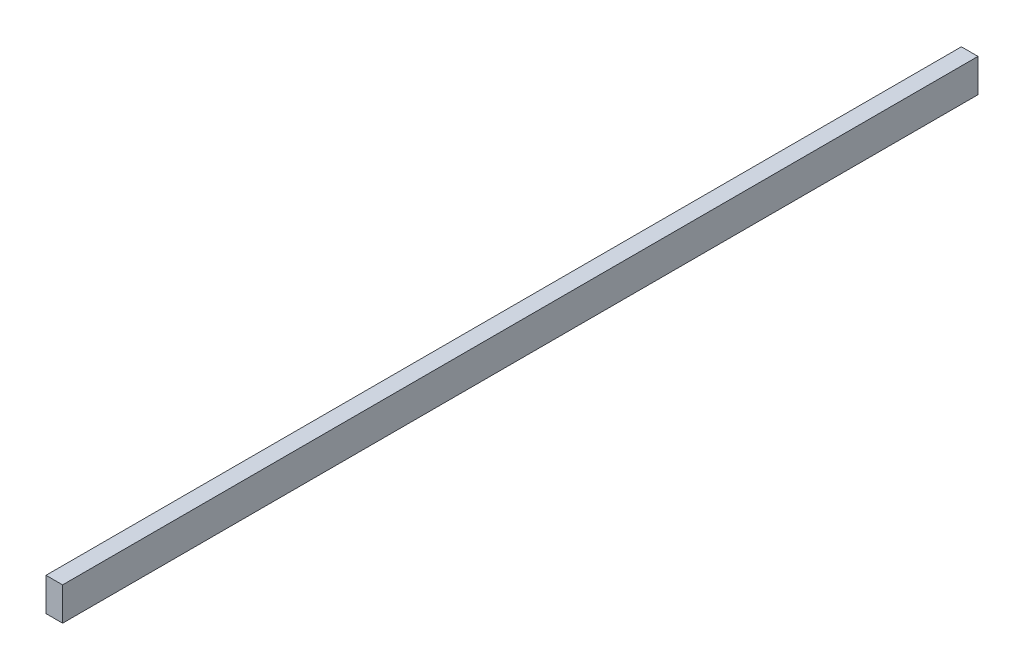
ISO-10303-21;
HEADER;
FILE_DESCRIPTION(('STEP AP214'),'2;1');
FILE_NAME('part.step','',(''),(''),'','','');
FILE_SCHEMA(('AUTOMOTIVE_DESIGN { 1 0 10303 214 1 1 1 1 }'));
ENDSEC;
DATA;
#1=APPLICATION_CONTEXT('core data for automotive mechanical design processes');
#2=APPLICATION_PROTOCOL_DEFINITION('international standard','automotive_design',2000,#1);
#3=PRODUCT_CONTEXT('',#1,'mechanical');
#4=PRODUCT('Part','Part','',(#3));
#5=PRODUCT_RELATED_PRODUCT_CATEGORY('part','',(#4));
#6=PRODUCT_DEFINITION_FORMATION('','',#4);
#7=PRODUCT_DEFINITION_CONTEXT('part definition',#1,'design');
#8=PRODUCT_DEFINITION('design','',#6,#7);
#9=PRODUCT_DEFINITION_SHAPE('','',#8);
#10=(LENGTH_UNIT() NAMED_UNIT(*) SI_UNIT(.MILLI.,.METRE.));
#11=(NAMED_UNIT(*) PLANE_ANGLE_UNIT() SI_UNIT($,.RADIAN.));
#12=(NAMED_UNIT(*) SI_UNIT($,.STERADIAN.) SOLID_ANGLE_UNIT());
#13=UNCERTAINTY_MEASURE_WITH_UNIT(LENGTH_MEASURE(1.E-05),#10,'distance_accuracy_value','');
#14=(GEOMETRIC_REPRESENTATION_CONTEXT(3) GLOBAL_UNCERTAINTY_ASSIGNED_CONTEXT((#13)) GLOBAL_UNIT_ASSIGNED_CONTEXT((#10,
#11,#12)) REPRESENTATION_CONTEXT('',''));
#15=CARTESIAN_POINT('',(0.,0.,0.));
#16=DIRECTION('',(0.,0.,1.));
#17=DIRECTION('',(1.,0.,0.));
#18=AXIS2_PLACEMENT_3D('',#15,#16,#17);
#19=CARTESIAN_POINT('',(-6.35,-12.7,-700.));
#20=DIRECTION('',(-1.,0.,0.));
#21=DIRECTION('',(0.,0.,1.));
#22=AXIS2_PLACEMENT_3D('',#19,#20,#21);
#23=PLANE('',#22);
#24=DIRECTION('',(0.,-1.,0.));
#25=VECTOR('',#24,1.);
#26=CARTESIAN_POINT('',(-6.35,-12.7,0.));
#27=LINE('',#26,#25);
#28=CARTESIAN_POINT('',(-6.35,12.7,0.));
#29=VERTEX_POINT('',#28);
#30=CARTESIAN_POINT('',(-6.35,-12.7,0.));
#31=VERTEX_POINT('',#30);
#32=EDGE_CURVE('E97',#29,#31,#27,.T.);
#33=ORIENTED_EDGE('',*,*,#32,.F.);
#34=DIRECTION('',(0.,0.,1.));
#35=VECTOR('',#34,1.);
#36=CARTESIAN_POINT('',(-6.35,12.7,-700.));
#37=LINE('',#36,#35);
#38=CARTESIAN_POINT('',(-6.35,12.7,-700.));
#39=VERTEX_POINT('',#38);
#40=EDGE_CURVE('E11',#39,#29,#37,.T.);
#41=ORIENTED_EDGE('',*,*,#40,.F.);
#42=DIRECTION('',(0.,-1.,0.));
#43=VECTOR('',#42,1.);
#44=CARTESIAN_POINT('',(-6.35,-12.7,-700.));
#45=LINE('',#44,#43);
#46=CARTESIAN_POINT('',(-6.35,-12.7,-700.));
#47=VERTEX_POINT('',#46);
#48=EDGE_CURVE('E91',#39,#47,#45,.T.);
#49=ORIENTED_EDGE('',*,*,#48,.T.);
#50=DIRECTION('',(0.,0.,1.));
#51=VECTOR('',#50,1.);
#52=CARTESIAN_POINT('',(-6.35,-12.7,-700.));
#53=LINE('',#52,#51);
#54=EDGE_CURVE('E36',#47,#31,#53,.T.);
#55=ORIENTED_EDGE('',*,*,#54,.T.);
#56=EDGE_LOOP('',(#33,#41,#49,#55));
#57=FACE_BOUND('',#56,.T.);
#58=ADVANCED_FACE('F33',(#57),#23,.T.);
#59=CARTESIAN_POINT('',(6.35,12.7,-700.));
#60=DIRECTION('',(0.,1.,0.));
#61=DIRECTION('',(0.,0.,1.));
#62=AXIS2_PLACEMENT_3D('',#59,#60,#61);
#63=PLANE('',#62);
#64=DIRECTION('',(-1.,0.,0.));
#65=VECTOR('',#64,1.);
#66=CARTESIAN_POINT('',(6.35,12.7,0.));
#67=LINE('',#66,#65);
#68=CARTESIAN_POINT('',(6.35,12.7,0.));
#69=VERTEX_POINT('',#68);
#70=EDGE_CURVE('E93',#69,#29,#67,.T.);
#71=ORIENTED_EDGE('',*,*,#70,.F.);
#72=DIRECTION('',(0.,0.,1.));
#73=VECTOR('',#72,1.);
#74=CARTESIAN_POINT('',(6.35,12.7,-700.));
#75=LINE('',#74,#73);
#76=CARTESIAN_POINT('',(6.35,12.7,-700.));
#77=VERTEX_POINT('',#76);
#78=EDGE_CURVE('E42',#77,#69,#75,.T.);
#79=ORIENTED_EDGE('',*,*,#78,.F.);
#80=DIRECTION('',(-1.,0.,0.));
#81=VECTOR('',#80,1.);
#82=CARTESIAN_POINT('',(6.35,12.7,-700.));
#83=LINE('',#82,#81);
#84=EDGE_CURVE('E88',#77,#39,#83,.T.);
#85=ORIENTED_EDGE('',*,*,#84,.T.);
#86=ORIENTED_EDGE('',*,*,#40,.T.);
#87=EDGE_LOOP('',(#71,#79,#85,#86));
#88=FACE_BOUND('',#87,.T.);
#89=ADVANCED_FACE('F107',(#88),#63,.T.);
#90=CARTESIAN_POINT('',(6.35,-12.7,-700.));
#91=DIRECTION('',(1.,0.,0.));
#92=DIRECTION('',(0.,0.,-1.));
#93=AXIS2_PLACEMENT_3D('',#90,#91,#92);
#94=PLANE('',#93);
#95=DIRECTION('',(0.,1.,0.));
#96=VECTOR('',#95,1.);
#97=CARTESIAN_POINT('',(6.35,-12.7,0.));
#98=LINE('',#97,#96);
#99=CARTESIAN_POINT('',(6.35,-12.7,0.));
#100=VERTEX_POINT('',#99);
#101=EDGE_CURVE('E83',#100,#69,#98,.T.);
#102=ORIENTED_EDGE('',*,*,#101,.F.);
#103=DIRECTION('',(0.,0.,1.));
#104=VECTOR('',#103,1.);
#105=CARTESIAN_POINT('',(6.35,-12.7,-700.));
#106=LINE('',#105,#104);
#107=CARTESIAN_POINT('',(6.35,-12.7,-700.));
#108=VERTEX_POINT('',#107);
#109=EDGE_CURVE('E78',#108,#100,#106,.T.);
#110=ORIENTED_EDGE('',*,*,#109,.F.);
#111=DIRECTION('',(0.,1.,0.));
#112=VECTOR('',#111,1.);
#113=CARTESIAN_POINT('',(6.35,-12.7,-700.));
#114=LINE('',#113,#112);
#115=EDGE_CURVE('E81',#108,#77,#114,.T.);
#116=ORIENTED_EDGE('',*,*,#115,.T.);
#117=ORIENTED_EDGE('',*,*,#78,.T.);
#118=EDGE_LOOP('',(#102,#110,#116,#117));
#119=FACE_BOUND('',#118,.T.);
#120=ADVANCED_FACE('F80',(#119),#94,.T.);
#121=CARTESIAN_POINT('',(6.35,-12.7,-700.));
#122=DIRECTION('',(0.,-1.,0.));
#123=DIRECTION('',(1.,0.,0.));
#124=AXIS2_PLACEMENT_3D('',#121,#122,#123);
#125=PLANE('',#124);
#126=DIRECTION('',(1.,0.,0.));
#127=VECTOR('',#126,1.);
#128=CARTESIAN_POINT('',(6.35,-12.7,0.));
#129=LINE('',#128,#127);
#130=EDGE_CURVE('E100',#31,#100,#129,.T.);
#131=ORIENTED_EDGE('',*,*,#130,.F.);
#132=ORIENTED_EDGE('',*,*,#54,.F.);
#133=DIRECTION('',(1.,0.,0.));
#134=VECTOR('',#133,1.);
#135=CARTESIAN_POINT('',(6.35,-12.7,-700.));
#136=LINE('',#135,#134);
#137=EDGE_CURVE('E87',#47,#108,#136,.T.);
#138=ORIENTED_EDGE('',*,*,#137,.T.);
#139=ORIENTED_EDGE('',*,*,#109,.T.);
#140=EDGE_LOOP('',(#131,#132,#138,#139));
#141=FACE_BOUND('',#140,.T.);
#142=ADVANCED_FACE('F90',(#141),#125,.T.);
#143=CARTESIAN_POINT('',(0.,0.,-700.));
#144=DIRECTION('',(0.,0.,1.));
#145=DIRECTION('',(1.,0.,0.));
#146=AXIS2_PLACEMENT_3D('',#143,#144,#145);
#147=PLANE('',#146);
#148=ORIENTED_EDGE('',*,*,#48,.F.);
#149=ORIENTED_EDGE('',*,*,#84,.F.);
#150=ORIENTED_EDGE('',*,*,#115,.F.);
#151=ORIENTED_EDGE('',*,*,#137,.F.);
#152=EDGE_LOOP('',(#148,#149,#150,#151));
#153=FACE_BOUND('',#152,.T.);
#154=ADVANCED_FACE('F86',(#153),#147,.F.);
#155=CARTESIAN_POINT('',(0.,0.,0.));
#156=DIRECTION('',(0.,0.,1.));
#157=DIRECTION('',(1.,0.,0.));
#158=AXIS2_PLACEMENT_3D('',#155,#156,#157);
#159=PLANE('',#158);
#160=ORIENTED_EDGE('',*,*,#32,.T.);
#161=ORIENTED_EDGE('',*,*,#130,.T.);
#162=ORIENTED_EDGE('',*,*,#101,.T.);
#163=ORIENTED_EDGE('',*,*,#70,.T.);
#164=EDGE_LOOP('',(#160,#161,#162,#163));
#165=FACE_BOUND('',#164,.T.);
#166=ADVANCED_FACE('F106',(#165),#159,.T.);
#167=CLOSED_SHELL('',(#58,#89,#120,#142,#154,#166));
#168=MANIFOLD_SOLID_BREP('B2',#167);
#169=ADVANCED_BREP_SHAPE_REPRESENTATION('',(#18,#168),#14);
#170=SHAPE_DEFINITION_REPRESENTATION(#9,#169);
ENDSEC;
END-ISO-10303-21;
